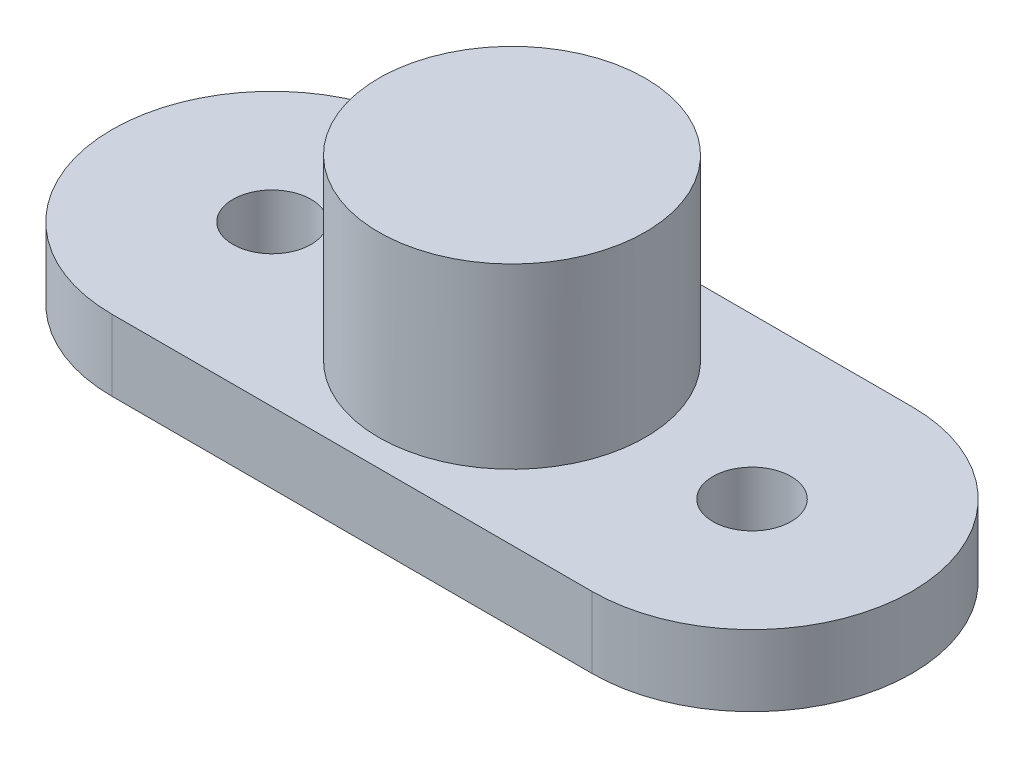
ISO-10303-21;
HEADER;
FILE_DESCRIPTION(('STEP AP214'),'2;1');
FILE_NAME('part.step','',(''),(''),'','','');
FILE_SCHEMA(('AUTOMOTIVE_DESIGN { 1 0 10303 214 1 1 1 1 }'));
ENDSEC;
DATA;
#1=APPLICATION_CONTEXT('core data for automotive mechanical design processes');
#2=APPLICATION_PROTOCOL_DEFINITION('international standard','automotive_design',2000,#1);
#3=PRODUCT_CONTEXT('',#1,'mechanical');
#4=PRODUCT('Part','Part','',(#3));
#5=PRODUCT_RELATED_PRODUCT_CATEGORY('part','',(#4));
#6=PRODUCT_DEFINITION_FORMATION('','',#4);
#7=PRODUCT_DEFINITION_CONTEXT('part definition',#1,'design');
#8=PRODUCT_DEFINITION('design','',#6,#7);
#9=PRODUCT_DEFINITION_SHAPE('','',#8);
#10=(LENGTH_UNIT() NAMED_UNIT(*) SI_UNIT(.MILLI.,.METRE.));
#11=(NAMED_UNIT(*) PLANE_ANGLE_UNIT() SI_UNIT($,.RADIAN.));
#12=(NAMED_UNIT(*) SI_UNIT($,.STERADIAN.) SOLID_ANGLE_UNIT());
#13=UNCERTAINTY_MEASURE_WITH_UNIT(LENGTH_MEASURE(1.E-05),#10,'distance_accuracy_value','');
#14=(GEOMETRIC_REPRESENTATION_CONTEXT(3) GLOBAL_UNCERTAINTY_ASSIGNED_CONTEXT((#13)) GLOBAL_UNIT_ASSIGNED_CONTEXT((#10,
#11,#12)) REPRESENTATION_CONTEXT('',''));
#15=CARTESIAN_POINT('',(0.,0.,0.));
#16=DIRECTION('',(0.,0.,1.));
#17=DIRECTION('',(1.,0.,0.));
#18=AXIS2_PLACEMENT_3D('',#15,#16,#17);
#19=CARTESIAN_POINT('',(0.,2.,-4.49950296687665));
#20=DIRECTION('',(0.,0.,-1.));
#21=DIRECTION('',(-1.,0.,0.));
#22=AXIS2_PLACEMENT_3D('',#19,#20,#21);
#23=PLANE('',#22);
#24=DIRECTION('',(1.,0.,0.));
#25=VECTOR('',#24,1.);
#26=CARTESIAN_POINT('',(0.,0.,-4.49950296687665));
#27=LINE('',#26,#25);
#28=CARTESIAN_POINT('',(-6.75,0.,-4.49950296687665));
#29=VERTEX_POINT('',#28);
#30=CARTESIAN_POINT('',(6.75,0.,-4.49950296687665));
#31=VERTEX_POINT('',#30);
#32=EDGE_CURVE('E119',#29,#31,#27,.T.);
#33=ORIENTED_EDGE('',*,*,#32,.F.);
#34=DIRECTION('',(0.,-1.,0.));
#35=VECTOR('',#34,1.);
#36=CARTESIAN_POINT('',(-6.75,2.,-4.49950296687665));
#37=LINE('',#36,#35);
#38=CARTESIAN_POINT('',(-6.75,2.,-4.49950296687665));
#39=VERTEX_POINT('',#38);
#40=EDGE_CURVE('E11',#39,#29,#37,.T.);
#41=ORIENTED_EDGE('',*,*,#40,.F.);
#42=DIRECTION('',(1.,0.,0.));
#43=VECTOR('',#42,1.);
#44=CARTESIAN_POINT('',(0.,2.,-4.49950296687665));
#45=LINE('',#44,#43);
#46=CARTESIAN_POINT('',(6.75,2.,-4.49950296687665));
#47=VERTEX_POINT('',#46);
#48=EDGE_CURVE('E96',#39,#47,#45,.T.);
#49=ORIENTED_EDGE('',*,*,#48,.T.);
#50=DIRECTION('',(0.,-1.,0.));
#51=VECTOR('',#50,1.);
#52=CARTESIAN_POINT('',(6.75,2.,-4.49950296687665));
#53=LINE('',#52,#51);
#54=EDGE_CURVE('E57',#47,#31,#53,.T.);
#55=ORIENTED_EDGE('',*,*,#54,.T.);
#56=EDGE_LOOP('',(#33,#41,#49,#55));
#57=FACE_BOUND('',#56,.T.);
#58=ADVANCED_FACE('F39',(#57),#23,.T.);
#59=CARTESIAN_POINT('',(-6.75,2.,0.));
#60=DIRECTION('',(0.,-1.,0.));
#61=DIRECTION('',(0.,0.,-1.));
#62=AXIS2_PLACEMENT_3D('',#59,#60,#61);
#63=CYLINDRICAL_SURFACE('',#62,4.49950296687665);
#64=CARTESIAN_POINT('',(-6.75,0.,0.));
#65=DIRECTION('',(0.,1.,0.));
#66=DIRECTION('',(0.,0.,1.));
#67=AXIS2_PLACEMENT_3D('',#64,#65,#66);
#68=CIRCLE('',#67,4.49950296687665);
#69=CARTESIAN_POINT('',(-6.75,0.,4.49950296687665));
#70=VERTEX_POINT('',#69);
#71=EDGE_CURVE('E102',#29,#70,#68,.T.);
#72=ORIENTED_EDGE('',*,*,#71,.T.);
#73=DIRECTION('',(0.,-1.,0.));
#74=VECTOR('',#73,1.);
#75=CARTESIAN_POINT('',(-6.75,2.,4.49950296687665));
#76=LINE('',#75,#74);
#77=CARTESIAN_POINT('',(-6.75,2.,4.49950296687665));
#78=VERTEX_POINT('',#77);
#79=EDGE_CURVE('E49',#78,#70,#76,.T.);
#80=ORIENTED_EDGE('',*,*,#79,.F.);
#81=CARTESIAN_POINT('',(-6.75,2.,0.));
#82=DIRECTION('',(0.,1.,0.));
#83=DIRECTION('',(0.,0.,1.));
#84=AXIS2_PLACEMENT_3D('',#81,#82,#83);
#85=CIRCLE('',#84,4.49950296687665);
#86=EDGE_CURVE('E92',#39,#78,#85,.T.);
#87=ORIENTED_EDGE('',*,*,#86,.F.);
#88=ORIENTED_EDGE('',*,*,#40,.T.);
#89=EDGE_LOOP('',(#72,#80,#87,#88));
#90=FACE_BOUND('',#89,.T.);
#91=ADVANCED_FACE('F100',(#90),#63,.T.);
#92=CARTESIAN_POINT('',(0.,2.,4.49950296687665));
#93=DIRECTION('',(0.,0.,-1.));
#94=DIRECTION('',(-1.,0.,0.));
#95=AXIS2_PLACEMENT_3D('',#92,#93,#94);
#96=PLANE('',#95);
#97=DIRECTION('',(1.,0.,0.));
#98=VECTOR('',#97,1.);
#99=CARTESIAN_POINT('',(0.,0.,4.49950296687665));
#100=LINE('',#99,#98);
#101=CARTESIAN_POINT('',(6.75,0.,4.49950296687665));
#102=VERTEX_POINT('',#101);
#103=EDGE_CURVE('E114',#70,#102,#100,.T.);
#104=ORIENTED_EDGE('',*,*,#103,.T.);
#105=DIRECTION('',(0.,-1.,0.));
#106=VECTOR('',#105,1.);
#107=CARTESIAN_POINT('',(6.75,2.,4.49950296687665));
#108=LINE('',#107,#106);
#109=CARTESIAN_POINT('',(6.75,2.,4.49950296687665));
#110=VERTEX_POINT('',#109);
#111=EDGE_CURVE('E71',#110,#102,#108,.T.);
#112=ORIENTED_EDGE('',*,*,#111,.F.);
#113=DIRECTION('',(1.,0.,0.));
#114=VECTOR('',#113,1.);
#115=CARTESIAN_POINT('',(0.,2.,4.49950296687665));
#116=LINE('',#115,#114);
#117=EDGE_CURVE('E83',#78,#110,#116,.T.);
#118=ORIENTED_EDGE('',*,*,#117,.F.);
#119=ORIENTED_EDGE('',*,*,#79,.T.);
#120=EDGE_LOOP('',(#104,#112,#118,#119));
#121=FACE_BOUND('',#120,.T.);
#122=ADVANCED_FACE('F85',(#121),#96,.F.);
#123=CARTESIAN_POINT('',(-6.75,2.,0.));
#124=DIRECTION('',(0.,-1.,0.));
#125=DIRECTION('',(0.,0.,-1.));
#126=AXIS2_PLACEMENT_3D('',#123,#124,#125);
#127=CYLINDRICAL_SURFACE('',#126,1.1);
#128=CARTESIAN_POINT('',(-6.75,2.,0.));
#129=DIRECTION('',(0.,1.,0.));
#130=DIRECTION('',(0.,0.,1.));
#131=AXIS2_PLACEMENT_3D('',#128,#129,#130);
#132=CIRCLE('',#131,1.1);
#133=CARTESIAN_POINT('',(-6.75,2.,1.1));
#134=VERTEX_POINT('',#133);
#135=EDGE_CURVE('E139',#134,#134,#132,.T.);
#136=ORIENTED_EDGE('',*,*,#135,.T.);
#137=EDGE_LOOP('',(#136));
#138=FACE_BOUND('',#137,.T.);
#139=CARTESIAN_POINT('',(-6.75,0.,0.));
#140=DIRECTION('',(0.,1.,0.));
#141=DIRECTION('',(0.,0.,1.));
#142=AXIS2_PLACEMENT_3D('',#139,#140,#141);
#143=CIRCLE('',#142,1.1);
#144=CARTESIAN_POINT('',(-6.75,0.,1.1));
#145=VERTEX_POINT('',#144);
#146=EDGE_CURVE('E122',#145,#145,#143,.T.);
#147=ORIENTED_EDGE('',*,*,#146,.F.);
#148=EDGE_LOOP('',(#147));
#149=FACE_BOUND('',#148,.T.);
#150=ADVANCED_FACE('F168',(#138,#149),#127,.F.);
#151=CARTESIAN_POINT('',(6.75,2.,0.));
#152=DIRECTION('',(0.,-1.,0.));
#153=DIRECTION('',(0.,0.,-1.));
#154=AXIS2_PLACEMENT_3D('',#151,#152,#153);
#155=CYLINDRICAL_SURFACE('',#154,1.1);
#156=CARTESIAN_POINT('',(6.75,2.,0.));
#157=DIRECTION('',(0.,1.,0.));
#158=DIRECTION('',(0.,0.,1.));
#159=AXIS2_PLACEMENT_3D('',#156,#157,#158);
#160=CIRCLE('',#159,1.1);
#161=CARTESIAN_POINT('',(6.75,2.,1.1));
#162=VERTEX_POINT('',#161);
#163=EDGE_CURVE('E113',#162,#162,#160,.T.);
#164=ORIENTED_EDGE('',*,*,#163,.T.);
#165=EDGE_LOOP('',(#164));
#166=FACE_BOUND('',#165,.T.);
#167=CARTESIAN_POINT('',(6.75,0.,0.));
#168=DIRECTION('',(0.,1.,0.));
#169=DIRECTION('',(0.,0.,1.));
#170=AXIS2_PLACEMENT_3D('',#167,#168,#169);
#171=CIRCLE('',#170,1.1);
#172=CARTESIAN_POINT('',(6.75,0.,1.1));
#173=VERTEX_POINT('',#172);
#174=EDGE_CURVE('E126',#173,#173,#171,.T.);
#175=ORIENTED_EDGE('',*,*,#174,.F.);
#176=EDGE_LOOP('',(#175));
#177=FACE_BOUND('',#176,.T.);
#178=ADVANCED_FACE('F41',(#166,#177),#155,.F.);
#179=CARTESIAN_POINT('',(6.75,2.,0.));
#180=DIRECTION('',(0.,-1.,0.));
#181=DIRECTION('',(0.,0.,-1.));
#182=AXIS2_PLACEMENT_3D('',#179,#180,#181);
#183=CYLINDRICAL_SURFACE('',#182,4.49950296687665);
#184=CARTESIAN_POINT('',(6.75,0.,0.));
#185=DIRECTION('',(0.,1.,0.));
#186=DIRECTION('',(0.,0.,1.));
#187=AXIS2_PLACEMENT_3D('',#184,#185,#186);
#188=CIRCLE('',#187,4.49950296687665);
#189=EDGE_CURVE('E109',#31,#102,#188,.F.);
#190=ORIENTED_EDGE('',*,*,#189,.F.);
#191=ORIENTED_EDGE('',*,*,#54,.F.);
#192=CARTESIAN_POINT('',(6.75,2.,0.));
#193=DIRECTION('',(0.,1.,0.));
#194=DIRECTION('',(0.,0.,1.));
#195=AXIS2_PLACEMENT_3D('',#192,#193,#194);
#196=CIRCLE('',#195,4.49950296687665);
#197=EDGE_CURVE('E91',#47,#110,#196,.F.);
#198=ORIENTED_EDGE('',*,*,#197,.T.);
#199=ORIENTED_EDGE('',*,*,#111,.T.);
#200=EDGE_LOOP('',(#190,#191,#198,#199));
#201=FACE_BOUND('',#200,.T.);
#202=ADVANCED_FACE('F175',(#201),#183,.T.);
#203=CARTESIAN_POINT('',(0.,2.,0.));
#204=DIRECTION('',(0.,1.,0.));
#205=DIRECTION('',(0.,0.,1.));
#206=AXIS2_PLACEMENT_3D('',#203,#204,#205);
#207=PLANE('',#206);
#208=ORIENTED_EDGE('',*,*,#163,.F.);
#209=EDGE_LOOP('',(#208));
#210=FACE_BOUND('',#209,.T.);
#211=ORIENTED_EDGE('',*,*,#135,.F.);
#212=EDGE_LOOP('',(#211));
#213=FACE_BOUND('',#212,.T.);
#214=CARTESIAN_POINT('',(0.,2.,0.));
#215=DIRECTION('',(0.,1.,0.));
#216=DIRECTION('',(0.,0.,1.));
#217=AXIS2_PLACEMENT_3D('',#214,#215,#216);
#218=CIRCLE('',#217,3.75);
#219=CARTESIAN_POINT('',(0.,2.,3.75));
#220=VERTEX_POINT('',#219);
#221=EDGE_CURVE('E135',#220,#220,#218,.T.);
#222=ORIENTED_EDGE('',*,*,#221,.F.);
#223=EDGE_LOOP('',(#222));
#224=FACE_BOUND('',#223,.T.);
#225=ORIENTED_EDGE('',*,*,#48,.F.);
#226=ORIENTED_EDGE('',*,*,#86,.T.);
#227=ORIENTED_EDGE('',*,*,#117,.T.);
#228=ORIENTED_EDGE('',*,*,#197,.F.);
#229=EDGE_LOOP('',(#225,#226,#227,#228));
#230=FACE_BOUND('',#229,.T.);
#231=ADVANCED_FACE('F95',(#210,#213,#224,#230),#207,.T.);
#232=CARTESIAN_POINT('',(0.,0.,0.));
#233=DIRECTION('',(0.,1.,0.));
#234=DIRECTION('',(0.,0.,1.));
#235=AXIS2_PLACEMENT_3D('',#232,#233,#234);
#236=PLANE('',#235);
#237=ORIENTED_EDGE('',*,*,#174,.T.);
#238=EDGE_LOOP('',(#237));
#239=FACE_BOUND('',#238,.T.);
#240=ORIENTED_EDGE('',*,*,#146,.T.);
#241=EDGE_LOOP('',(#240));
#242=FACE_BOUND('',#241,.T.);
#243=ORIENTED_EDGE('',*,*,#32,.T.);
#244=ORIENTED_EDGE('',*,*,#189,.T.);
#245=ORIENTED_EDGE('',*,*,#103,.F.);
#246=ORIENTED_EDGE('',*,*,#71,.F.);
#247=EDGE_LOOP('',(#243,#244,#245,#246));
#248=FACE_BOUND('',#247,.T.);
#249=ADVANCED_FACE('F158',(#239,#242,#248),#236,.F.);
#250=CARTESIAN_POINT('',(0.,7.,0.));
#251=DIRECTION('',(0.,-1.,0.));
#252=DIRECTION('',(0.,0.,-1.));
#253=AXIS2_PLACEMENT_3D('',#250,#251,#252);
#254=CYLINDRICAL_SURFACE('',#253,3.75);
#255=ORIENTED_EDGE('',*,*,#221,.T.);
#256=EDGE_LOOP('',(#255));
#257=FACE_BOUND('',#256,.T.);
#258=CARTESIAN_POINT('',(0.,7.,0.));
#259=DIRECTION('',(0.,-1.,0.));
#260=DIRECTION('',(0.,0.,-1.));
#261=AXIS2_PLACEMENT_3D('',#258,#259,#260);
#262=CIRCLE('',#261,3.75);
#263=CARTESIAN_POINT('',(0.,7.,-3.75));
#264=VERTEX_POINT('',#263);
#265=EDGE_CURVE('E130',#264,#264,#262,.T.);
#266=ORIENTED_EDGE('',*,*,#265,.T.);
#267=EDGE_LOOP('',(#266));
#268=FACE_BOUND('',#267,.T.);
#269=ADVANCED_FACE('F150',(#257,#268),#254,.T.);
#270=CARTESIAN_POINT('',(0.,7.,0.));
#271=DIRECTION('',(0.,-1.,0.));
#272=DIRECTION('',(0.,0.,-1.));
#273=AXIS2_PLACEMENT_3D('',#270,#271,#272);
#274=PLANE('',#273);
#275=ORIENTED_EDGE('',*,*,#265,.F.);
#276=EDGE_LOOP('',(#275));
#277=FACE_BOUND('',#276,.T.);
#278=ADVANCED_FACE('F152',(#277),#274,.F.);
#279=CLOSED_SHELL('',(#58,#91,#122,#150,#178,#202,#231,#249,#269,#278));
#280=MANIFOLD_SOLID_BREP('B2',#279);
#281=ADVANCED_BREP_SHAPE_REPRESENTATION('',(#18,#280),#14);
#282=SHAPE_DEFINITION_REPRESENTATION(#9,#281);
ENDSEC;
END-ISO-10303-21;
